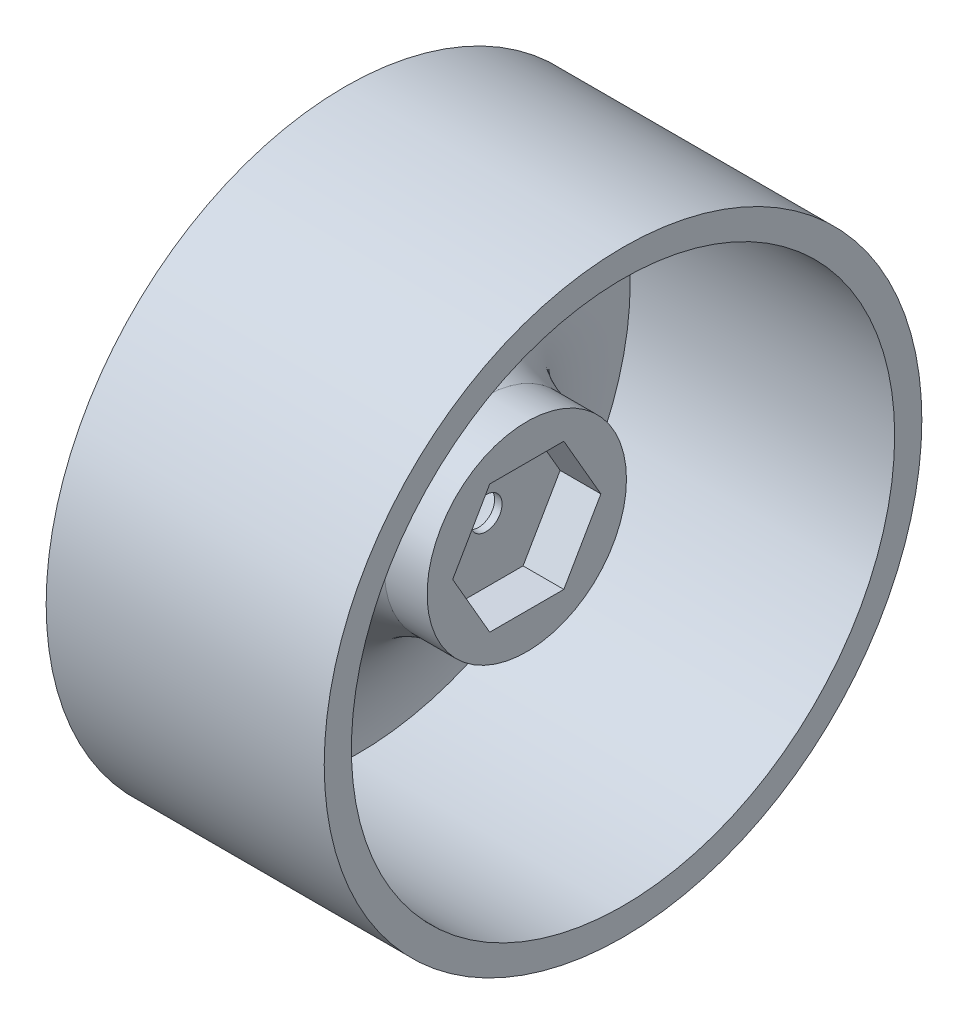
ISO-10303-21;
HEADER;
FILE_DESCRIPTION(('STEP AP214'),'2;1');
FILE_NAME('part.step','',(''),(''),'','','');
FILE_SCHEMA(('AUTOMOTIVE_DESIGN { 1 0 10303 214 1 1 1 1 }'));
ENDSEC;
DATA;
#1=APPLICATION_CONTEXT('core data for automotive mechanical design processes');
#2=APPLICATION_PROTOCOL_DEFINITION('international standard','automotive_design',2000,#1);
#3=PRODUCT_CONTEXT('',#1,'mechanical');
#4=PRODUCT('Part','Part','',(#3));
#5=PRODUCT_RELATED_PRODUCT_CATEGORY('part','',(#4));
#6=PRODUCT_DEFINITION_FORMATION('','',#4);
#7=PRODUCT_DEFINITION_CONTEXT('part definition',#1,'design');
#8=PRODUCT_DEFINITION('design','',#6,#7);
#9=PRODUCT_DEFINITION_SHAPE('','',#8);
#10=(LENGTH_UNIT() NAMED_UNIT(*) SI_UNIT(.MILLI.,.METRE.));
#11=(NAMED_UNIT(*) PLANE_ANGLE_UNIT() SI_UNIT($,.RADIAN.));
#12=(NAMED_UNIT(*) SI_UNIT($,.STERADIAN.) SOLID_ANGLE_UNIT());
#13=UNCERTAINTY_MEASURE_WITH_UNIT(LENGTH_MEASURE(1.E-05),#10,'distance_accuracy_value','');
#14=(GEOMETRIC_REPRESENTATION_CONTEXT(3) GLOBAL_UNCERTAINTY_ASSIGNED_CONTEXT((#13)) GLOBAL_UNIT_ASSIGNED_CONTEXT((#10,
#11,#12)) REPRESENTATION_CONTEXT('',''));
#15=CARTESIAN_POINT('',(0.,0.,0.));
#16=DIRECTION('',(0.,0.,1.));
#17=DIRECTION('',(1.,0.,0.));
#18=AXIS2_PLACEMENT_3D('',#15,#16,#17);
#19=CARTESIAN_POINT('',(4.,0.,0.));
#20=DIRECTION('',(1.,0.,0.));
#21=DIRECTION('',(0.,0.,-1.));
#22=AXIS2_PLACEMENT_3D('',#19,#20,#21);
#23=CYLINDRICAL_SURFACE('',#22,25.4);
#24=CARTESIAN_POINT('',(13.000000035,0.,0.));
#25=DIRECTION('',(1.,0.,0.));
#26=DIRECTION('',(0.,0.,-1.));
#27=AXIS2_PLACEMENT_3D('',#24,#25,#26);
#28=CIRCLE('',#27,25.4);
#29=CARTESIAN_POINT('',(13.000000035,0.,-25.4));
#30=VERTEX_POINT('',#29);
#31=EDGE_CURVE('E11',#30,#30,#28,.T.);
#32=ORIENTED_EDGE('',*,*,#31,.T.);
#33=EDGE_LOOP('',(#32));
#34=FACE_BOUND('',#33,.T.);
#35=CARTESIAN_POINT('',(-11.730000035,0.,0.));
#36=DIRECTION('',(1.,0.,0.));
#37=DIRECTION('',(0.,0.,-1.));
#38=AXIS2_PLACEMENT_3D('',#35,#36,#37);
#39=CIRCLE('',#38,25.4);
#40=CARTESIAN_POINT('',(-11.730000035,0.,-25.4));
#41=VERTEX_POINT('',#40);
#42=EDGE_CURVE('E140',#41,#41,#39,.T.);
#43=ORIENTED_EDGE('',*,*,#42,.F.);
#44=EDGE_LOOP('',(#43));
#45=FACE_BOUND('',#44,.T.);
#46=ADVANCED_FACE('F38',(#34,#45),#23,.F.);
#47=CARTESIAN_POINT('',(13.000000035,0.,-27.94));
#48=DIRECTION('',(-1.,0.,0.));
#49=DIRECTION('',(0.,0.,1.));
#50=AXIS2_PLACEMENT_3D('',#47,#48,#49);
#51=PLANE('',#50);
#52=ORIENTED_EDGE('',*,*,#31,.F.);
#53=EDGE_LOOP('',(#52));
#54=FACE_BOUND('',#53,.T.);
#55=CARTESIAN_POINT('',(13.000000035,0.,0.));
#56=DIRECTION('',(1.,0.,0.));
#57=DIRECTION('',(0.,0.,-1.));
#58=AXIS2_PLACEMENT_3D('',#55,#56,#57);
#59=CIRCLE('',#58,27.94);
#60=CARTESIAN_POINT('',(13.000000035,0.,-27.94));
#61=VERTEX_POINT('',#60);
#62=EDGE_CURVE('E46',#61,#61,#59,.T.);
#63=ORIENTED_EDGE('',*,*,#62,.T.);
#64=EDGE_LOOP('',(#63));
#65=FACE_BOUND('',#64,.T.);
#66=ADVANCED_FACE('F171',(#54,#65),#51,.F.);
#67=CARTESIAN_POINT('',(4.,0.,0.));
#68=DIRECTION('',(1.,0.,0.));
#69=DIRECTION('',(0.,0.,-1.));
#70=AXIS2_PLACEMENT_3D('',#67,#68,#69);
#71=CYLINDRICAL_SURFACE('',#70,27.94);
#72=ORIENTED_EDGE('',*,*,#62,.F.);
#73=EDGE_LOOP('',(#72));
#74=FACE_BOUND('',#73,.T.);
#75=CARTESIAN_POINT('',(-13.000000035,0.,0.));
#76=DIRECTION('',(1.,0.,0.));
#77=DIRECTION('',(0.,0.,-1.));
#78=AXIS2_PLACEMENT_3D('',#75,#76,#77);
#79=CIRCLE('',#78,27.94);
#80=CARTESIAN_POINT('',(-13.000000035,0.,-27.94));
#81=VERTEX_POINT('',#80);
#82=EDGE_CURVE('E183',#81,#81,#79,.T.);
#83=ORIENTED_EDGE('',*,*,#82,.T.);
#84=EDGE_LOOP('',(#83));
#85=FACE_BOUND('',#84,.T.);
#86=ADVANCED_FACE('F168',(#74,#85),#71,.T.);
#87=CARTESIAN_POINT('',(-13.000000035,0.,-25.4));
#88=DIRECTION('',(1.,0.,0.));
#89=DIRECTION('',(0.,0.,-1.));
#90=AXIS2_PLACEMENT_3D('',#87,#88,#89);
#91=PLANE('',#90);
#92=ORIENTED_EDGE('',*,*,#82,.F.);
#93=EDGE_LOOP('',(#92));
#94=FACE_BOUND('',#93,.T.);
#95=CARTESIAN_POINT('',(-13.000000035,0.,0.));
#96=DIRECTION('',(1.,0.,0.));
#97=DIRECTION('',(0.,0.,-1.));
#98=AXIS2_PLACEMENT_3D('',#95,#96,#97);
#99=CIRCLE('',#98,25.4);
#100=CARTESIAN_POINT('',(-13.000000035,0.,-25.4));
#101=VERTEX_POINT('',#100);
#102=EDGE_CURVE('E186',#101,#101,#99,.T.);
#103=ORIENTED_EDGE('',*,*,#102,.T.);
#104=EDGE_LOOP('',(#103));
#105=FACE_BOUND('',#104,.T.);
#106=ADVANCED_FACE('F163',(#94,#105),#91,.F.);
#107=CARTESIAN_POINT('',(-0.508,0.,-8.128));
#108=CARTESIAN_POINT('',(-13.159061445429,0.,-7.33668886150366));
#109=CARTESIAN_POINT('',(-13.000000035,0.,-25.4));
#110=B_SPLINE_CURVE_WITH_KNOTS('',2,(#107,#108,#109),.UNSPECIFIED.,.F.,.F.,(3,3),(0.,1.),.UNSPECIFIED.);
#111=CARTESIAN_POINT('',(4.,0.,0.));
#112=DIRECTION('',(1.,0.,0.));
#113=AXIS1_PLACEMENT('',#111,#112);
#114=SURFACE_OF_REVOLUTION('',#110,#113);
#115=ORIENTED_EDGE('',*,*,#102,.F.);
#116=EDGE_LOOP('',(#115));
#117=FACE_BOUND('',#116,.T.);
#118=CARTESIAN_POINT('',(-0.508,0.,0.));
#119=DIRECTION('',(1.,0.,0.));
#120=DIRECTION('',(0.,0.,-1.));
#121=AXIS2_PLACEMENT_3D('',#118,#119,#120);
#122=CIRCLE('',#121,8.128);
#123=CARTESIAN_POINT('',(-0.508,0.,-8.128));
#124=VERTEX_POINT('',#123);
#125=EDGE_CURVE('E191',#124,#124,#122,.T.);
#126=ORIENTED_EDGE('',*,*,#125,.T.);
#127=EDGE_LOOP('',(#126));
#128=FACE_BOUND('',#127,.T.);
#129=ADVANCED_FACE('F158',(#117,#128),#114,.T.);
#130=CARTESIAN_POINT('',(-0.508,0.,-8.128));
#131=DIRECTION('',(-1.,0.,0.));
#132=DIRECTION('',(0.,0.,1.));
#133=AXIS2_PLACEMENT_3D('',#130,#131,#132);
#134=PLANE('',#133);
#135=CARTESIAN_POINT('',(-0.508,0.,0.));
#136=DIRECTION('',(-1.,0.,0.));
#137=DIRECTION('',(0.,0.,1.));
#138=AXIS2_PLACEMENT_3D('',#135,#136,#137);
#139=CIRCLE('',#138,1.5);
#140=CARTESIAN_POINT('',(-0.508,0.,1.5));
#141=VERTEX_POINT('',#140);
#142=EDGE_CURVE('E236',#141,#141,#139,.T.);
#143=ORIENTED_EDGE('',*,*,#142,.F.);
#144=EDGE_LOOP('',(#143));
#145=FACE_BOUND('',#144,.T.);
#146=ORIENTED_EDGE('',*,*,#125,.F.);
#147=EDGE_LOOP('',(#146));
#148=FACE_BOUND('',#147,.T.);
#149=ADVANCED_FACE('F162',(#145,#148),#134,.T.);
#150=CARTESIAN_POINT('',(4.,0.,-8.05052812049922));
#151=DIRECTION('',(1.,0.,0.));
#152=DIRECTION('',(0.,0.,-1.));
#153=AXIS2_PLACEMENT_3D('',#150,#151,#152);
#154=PLANE('',#153);
#155=DIRECTION('',(0.,0.866025403784439,-0.5));
#156=VECTOR('',#155,1.);
#157=CARTESIAN_POINT('',(4.,-6.,-3.46410161513776));
#158=LINE('',#157,#156);
#159=CARTESIAN_POINT('',(4.,-6.,-3.46410161513776));
#160=VERTEX_POINT('',#159);
#161=CARTESIAN_POINT('',(4.,0.,-6.92820323027551));
#162=VERTEX_POINT('',#161);
#163=EDGE_CURVE('E53',#160,#162,#158,.T.);
#164=ORIENTED_EDGE('',*,*,#163,.F.);
#165=DIRECTION('',(0.,0.,-1.));
#166=VECTOR('',#165,1.);
#167=CARTESIAN_POINT('',(4.,-6.,3.46410161513776));
#168=LINE('',#167,#166);
#169=CARTESIAN_POINT('',(4.,-6.,3.46410161513776));
#170=VERTEX_POINT('',#169);
#171=EDGE_CURVE('E136',#170,#160,#168,.T.);
#172=ORIENTED_EDGE('',*,*,#171,.F.);
#173=DIRECTION('',(0.,-0.866025403784439,-0.5));
#174=VECTOR('',#173,1.);
#175=CARTESIAN_POINT('',(4.,0.,6.92820323027551));
#176=LINE('',#175,#174);
#177=CARTESIAN_POINT('',(4.,0.,6.92820323027551));
#178=VERTEX_POINT('',#177);
#179=EDGE_CURVE('E134',#178,#170,#176,.T.);
#180=ORIENTED_EDGE('',*,*,#179,.F.);
#181=DIRECTION('',(0.,-0.866025403784439,0.5));
#182=VECTOR('',#181,1.);
#183=CARTESIAN_POINT('',(4.,6.,3.46410161513776));
#184=LINE('',#183,#182);
#185=CARTESIAN_POINT('',(4.,6.,3.46410161513776));
#186=VERTEX_POINT('',#185);
#187=EDGE_CURVE('E101',#186,#178,#184,.T.);
#188=ORIENTED_EDGE('',*,*,#187,.F.);
#189=DIRECTION('',(0.,0.,1.));
#190=VECTOR('',#189,1.);
#191=CARTESIAN_POINT('',(4.,6.,-3.46410161513775));
#192=LINE('',#191,#190);
#193=CARTESIAN_POINT('',(4.,6.,-3.46410161513775));
#194=VERTEX_POINT('',#193);
#195=EDGE_CURVE('E130',#194,#186,#192,.T.);
#196=ORIENTED_EDGE('',*,*,#195,.F.);
#197=DIRECTION('',(0.,0.866025403784438,0.5));
#198=VECTOR('',#197,1.);
#199=CARTESIAN_POINT('',(4.,0.,-6.92820323027551));
#200=LINE('',#199,#198);
#201=EDGE_CURVE('E127',#162,#194,#200,.T.);
#202=ORIENTED_EDGE('',*,*,#201,.F.);
#203=EDGE_LOOP('',(#164,#172,#180,#188,#196,#202));
#204=FACE_BOUND('',#203,.T.);
#205=CARTESIAN_POINT('',(4.,0.,0.));
#206=DIRECTION('',(1.,0.,0.));
#207=DIRECTION('',(0.,0.,-1.));
#208=AXIS2_PLACEMENT_3D('',#205,#206,#207);
#209=CIRCLE('',#208,9.32052812049922);
#210=CARTESIAN_POINT('',(4.,0.,-9.32052812049922));
#211=VERTEX_POINT('',#210);
#212=EDGE_CURVE('E194',#211,#211,#209,.T.);
#213=ORIENTED_EDGE('',*,*,#212,.T.);
#214=EDGE_LOOP('',(#213));
#215=FACE_BOUND('',#214,.T.);
#216=ADVANCED_FACE('F216',(#204,#215),#154,.T.);
#217=CARTESIAN_POINT('',(4.,0.,0.));
#218=DIRECTION('',(1.,0.,0.));
#219=DIRECTION('',(0.,0.,-1.));
#220=AXIS2_PLACEMENT_3D('',#217,#218,#219);
#221=CYLINDRICAL_SURFACE('',#220,9.32052812049922);
#222=CARTESIAN_POINT('',(0.,0.,0.));
#223=DIRECTION('',(1.,0.,0.));
#224=DIRECTION('',(0.,0.,-1.));
#225=AXIS2_PLACEMENT_3D('',#222,#223,#224);
#226=CIRCLE('',#225,9.32052812049922);
#227=CARTESIAN_POINT('',(0.,0.,-9.32052812049922));
#228=VERTEX_POINT('',#227);
#229=EDGE_CURVE('E197',#228,#228,#226,.T.);
#230=ORIENTED_EDGE('',*,*,#229,.T.);
#231=EDGE_LOOP('',(#230));
#232=FACE_BOUND('',#231,.T.);
#233=ORIENTED_EDGE('',*,*,#212,.F.);
#234=EDGE_LOOP('',(#233));
#235=FACE_BOUND('',#234,.T.);
#236=ADVANCED_FACE('F206',(#232,#235),#221,.T.);
#237=CARTESIAN_POINT('',(-11.730000035,0.,-25.4));
#238=CARTESIAN_POINT('',(-11.9398521547983,0.,-16.1859849480506));
#239=CARTESIAN_POINT('',(-5.76762494118269,0.,-10.5734857522698));
#240=CARTESIAN_POINT('',(0.,0.,-9.32052812049922));
#241=B_SPLINE_CURVE_WITH_KNOTS('',3,(#237,#238,#239,#240),.UNSPECIFIED.,.F.,.F.,(4,4),(0.,1.),.UNSPECIFIED.);
#242=CARTESIAN_POINT('',(4.,0.,0.));
#243=DIRECTION('',(1.,0.,0.));
#244=AXIS1_PLACEMENT('',#242,#243);
#245=SURFACE_OF_REVOLUTION('',#241,#244);
#246=ORIENTED_EDGE('',*,*,#229,.F.);
#247=EDGE_LOOP('',(#246));
#248=FACE_BOUND('',#247,.T.);
#249=ORIENTED_EDGE('',*,*,#42,.T.);
#250=EDGE_LOOP('',(#249));
#251=FACE_BOUND('',#250,.T.);
#252=ADVANCED_FACE('F202',(#248,#251),#245,.T.);
#253=CARTESIAN_POINT('',(0.190000000000001,-6.,-3.46410161513776));
#254=DIRECTION('',(0.,-0.5,-0.866025403784439));
#255=DIRECTION('',(0.,0.866025403784439,-0.5));
#256=AXIS2_PLACEMENT_3D('',#253,#254,#255);
#257=PLANE('',#256);
#258=ORIENTED_EDGE('',*,*,#163,.T.);
#259=DIRECTION('',(1.,0.,0.));
#260=VECTOR('',#259,1.);
#261=CARTESIAN_POINT('',(0.190000000000001,0.,-6.92820323027551));
#262=LINE('',#261,#260);
#263=CARTESIAN_POINT('',(0.190000000000001,0.,-6.92820323027551));
#264=VERTEX_POINT('',#263);
#265=EDGE_CURVE('E83',#264,#162,#262,.T.);
#266=ORIENTED_EDGE('',*,*,#265,.F.);
#267=DIRECTION('',(0.,0.866025403784439,-0.5));
#268=VECTOR('',#267,1.);
#269=CARTESIAN_POINT('',(0.190000000000001,-6.,-3.46410161513776));
#270=LINE('',#269,#268);
#271=CARTESIAN_POINT('',(0.190000000000001,-6.,-3.46410161513776));
#272=VERTEX_POINT('',#271);
#273=EDGE_CURVE('E138',#272,#264,#270,.T.);
#274=ORIENTED_EDGE('',*,*,#273,.F.);
#275=DIRECTION('',(1.,0.,0.));
#276=VECTOR('',#275,1.);
#277=CARTESIAN_POINT('',(0.190000000000001,-6.,-3.46410161513776));
#278=LINE('',#277,#276);
#279=EDGE_CURVE('E61',#272,#160,#278,.T.);
#280=ORIENTED_EDGE('',*,*,#279,.T.);
#281=EDGE_LOOP('',(#258,#266,#274,#280));
#282=FACE_BOUND('',#281,.T.);
#283=ADVANCED_FACE('F205',(#282),#257,.F.);
#284=CARTESIAN_POINT('',(0.190000000000001,-6.,3.46410161513776));
#285=DIRECTION('',(0.,-1.,0.));
#286=DIRECTION('',(0.,0.,-1.));
#287=AXIS2_PLACEMENT_3D('',#284,#285,#286);
#288=PLANE('',#287);
#289=ORIENTED_EDGE('',*,*,#171,.T.);
#290=ORIENTED_EDGE('',*,*,#279,.F.);
#291=DIRECTION('',(0.,0.,-1.));
#292=VECTOR('',#291,1.);
#293=CARTESIAN_POINT('',(0.190000000000001,-6.,3.46410161513776));
#294=LINE('',#293,#292);
#295=CARTESIAN_POINT('',(0.190000000000001,-6.,3.46410161513776));
#296=VERTEX_POINT('',#295);
#297=EDGE_CURVE('E113',#296,#272,#294,.T.);
#298=ORIENTED_EDGE('',*,*,#297,.F.);
#299=DIRECTION('',(1.,0.,0.));
#300=VECTOR('',#299,1.);
#301=CARTESIAN_POINT('',(0.190000000000001,-6.,3.46410161513776));
#302=LINE('',#301,#300);
#303=EDGE_CURVE('E105',#296,#170,#302,.T.);
#304=ORIENTED_EDGE('',*,*,#303,.T.);
#305=EDGE_LOOP('',(#289,#290,#298,#304));
#306=FACE_BOUND('',#305,.T.);
#307=ADVANCED_FACE('F214',(#306),#288,.F.);
#308=CARTESIAN_POINT('',(0.190000000000001,0.,6.92820323027551));
#309=DIRECTION('',(0.,-0.5,0.866025403784439));
#310=DIRECTION('',(0.,-0.866025403784439,-0.5));
#311=AXIS2_PLACEMENT_3D('',#308,#309,#310);
#312=PLANE('',#311);
#313=ORIENTED_EDGE('',*,*,#179,.T.);
#314=ORIENTED_EDGE('',*,*,#303,.F.);
#315=DIRECTION('',(0.,-0.866025403784439,-0.5));
#316=VECTOR('',#315,1.);
#317=CARTESIAN_POINT('',(0.190000000000001,0.,6.92820323027551));
#318=LINE('',#317,#316);
#319=CARTESIAN_POINT('',(0.190000000000001,0.,6.92820323027551));
#320=VERTEX_POINT('',#319);
#321=EDGE_CURVE('E109',#320,#296,#318,.T.);
#322=ORIENTED_EDGE('',*,*,#321,.F.);
#323=DIRECTION('',(1.,0.,0.));
#324=VECTOR('',#323,1.);
#325=CARTESIAN_POINT('',(0.190000000000001,0.,6.92820323027551));
#326=LINE('',#325,#324);
#327=EDGE_CURVE('E94',#320,#178,#326,.T.);
#328=ORIENTED_EDGE('',*,*,#327,.T.);
#329=EDGE_LOOP('',(#313,#314,#322,#328));
#330=FACE_BOUND('',#329,.T.);
#331=ADVANCED_FACE('F110',(#330),#312,.F.);
#332=CARTESIAN_POINT('',(0.190000000000001,6.,3.46410161513776));
#333=DIRECTION('',(0.,0.5,0.866025403784439));
#334=DIRECTION('',(0.,-0.866025403784439,0.5));
#335=AXIS2_PLACEMENT_3D('',#332,#333,#334);
#336=PLANE('',#335);
#337=ORIENTED_EDGE('',*,*,#187,.T.);
#338=ORIENTED_EDGE('',*,*,#327,.F.);
#339=DIRECTION('',(0.,-0.866025403784439,0.5));
#340=VECTOR('',#339,1.);
#341=CARTESIAN_POINT('',(0.190000000000001,6.,3.46410161513776));
#342=LINE('',#341,#340);
#343=CARTESIAN_POINT('',(0.190000000000001,6.,3.46410161513776));
#344=VERTEX_POINT('',#343);
#345=EDGE_CURVE('E98',#344,#320,#342,.T.);
#346=ORIENTED_EDGE('',*,*,#345,.F.);
#347=DIRECTION('',(1.,0.,0.));
#348=VECTOR('',#347,1.);
#349=CARTESIAN_POINT('',(0.190000000000001,6.,3.46410161513776));
#350=LINE('',#349,#348);
#351=EDGE_CURVE('E106',#344,#186,#350,.T.);
#352=ORIENTED_EDGE('',*,*,#351,.T.);
#353=EDGE_LOOP('',(#337,#338,#346,#352));
#354=FACE_BOUND('',#353,.T.);
#355=ADVANCED_FACE('F96',(#354),#336,.F.);
#356=CARTESIAN_POINT('',(0.190000000000001,6.,-3.46410161513775));
#357=DIRECTION('',(0.,1.,0.));
#358=DIRECTION('',(0.,0.,1.));
#359=AXIS2_PLACEMENT_3D('',#356,#357,#358);
#360=PLANE('',#359);
#361=ORIENTED_EDGE('',*,*,#195,.T.);
#362=ORIENTED_EDGE('',*,*,#351,.F.);
#363=DIRECTION('',(0.,0.,1.));
#364=VECTOR('',#363,1.);
#365=CARTESIAN_POINT('',(0.190000000000001,6.,-3.46410161513775));
#366=LINE('',#365,#364);
#367=CARTESIAN_POINT('',(0.190000000000001,6.,-3.46410161513775));
#368=VERTEX_POINT('',#367);
#369=EDGE_CURVE('E119',#368,#344,#366,.T.);
#370=ORIENTED_EDGE('',*,*,#369,.F.);
#371=DIRECTION('',(1.,0.,0.));
#372=VECTOR('',#371,1.);
#373=CARTESIAN_POINT('',(0.190000000000001,6.,-3.46410161513775));
#374=LINE('',#373,#372);
#375=EDGE_CURVE('E143',#368,#194,#374,.T.);
#376=ORIENTED_EDGE('',*,*,#375,.T.);
#377=EDGE_LOOP('',(#361,#362,#370,#376));
#378=FACE_BOUND('',#377,.T.);
#379=ADVANCED_FACE('F252',(#378),#360,.F.);
#380=CARTESIAN_POINT('',(0.190000000000001,0.,-6.92820323027551));
#381=DIRECTION('',(0.,0.5,-0.866025403784438));
#382=DIRECTION('',(0.,0.866025403784439,0.5));
#383=AXIS2_PLACEMENT_3D('',#380,#381,#382);
#384=PLANE('',#383);
#385=ORIENTED_EDGE('',*,*,#201,.T.);
#386=ORIENTED_EDGE('',*,*,#375,.F.);
#387=DIRECTION('',(0.,0.866025403784438,0.5));
#388=VECTOR('',#387,1.);
#389=CARTESIAN_POINT('',(0.190000000000001,0.,-6.92820323027551));
#390=LINE('',#389,#388);
#391=EDGE_CURVE('E121',#264,#368,#390,.T.);
#392=ORIENTED_EDGE('',*,*,#391,.F.);
#393=ORIENTED_EDGE('',*,*,#265,.T.);
#394=EDGE_LOOP('',(#385,#386,#392,#393));
#395=FACE_BOUND('',#394,.T.);
#396=ADVANCED_FACE('F233',(#395),#384,.F.);
#397=CARTESIAN_POINT('',(0.190000000000001,0.,0.));
#398=DIRECTION('',(1.,0.,0.));
#399=DIRECTION('',(0.,0.,-1.));
#400=AXIS2_PLACEMENT_3D('',#397,#398,#399);
#401=PLANE('',#400);
#402=CARTESIAN_POINT('',(0.190000000000001,0.,0.));
#403=DIRECTION('',(1.,0.,0.));
#404=DIRECTION('',(0.,0.,-1.));
#405=AXIS2_PLACEMENT_3D('',#402,#403,#404);
#406=CIRCLE('',#405,1.5);
#407=CARTESIAN_POINT('',(0.190000000000001,0.,-1.5));
#408=VERTEX_POINT('',#407);
#409=EDGE_CURVE('E41',#408,#408,#406,.T.);
#410=ORIENTED_EDGE('',*,*,#409,.F.);
#411=EDGE_LOOP('',(#410));
#412=FACE_BOUND('',#411,.T.);
#413=ORIENTED_EDGE('',*,*,#273,.T.);
#414=ORIENTED_EDGE('',*,*,#391,.T.);
#415=ORIENTED_EDGE('',*,*,#369,.T.);
#416=ORIENTED_EDGE('',*,*,#345,.T.);
#417=ORIENTED_EDGE('',*,*,#321,.T.);
#418=ORIENTED_EDGE('',*,*,#297,.T.);
#419=EDGE_LOOP('',(#413,#414,#415,#416,#417,#418));
#420=FACE_BOUND('',#419,.T.);
#421=ADVANCED_FACE('F116',(#412,#420),#401,.T.);
#422=CARTESIAN_POINT('',(13.000000035,0.,0.));
#423=DIRECTION('',(-1.,0.,0.));
#424=DIRECTION('',(0.,0.,1.));
#425=AXIS2_PLACEMENT_3D('',#422,#423,#424);
#426=CYLINDRICAL_SURFACE('',#425,1.5);
#427=ORIENTED_EDGE('',*,*,#409,.T.);
#428=EDGE_LOOP('',(#427));
#429=FACE_BOUND('',#428,.T.);
#430=ORIENTED_EDGE('',*,*,#142,.T.);
#431=EDGE_LOOP('',(#430));
#432=FACE_BOUND('',#431,.T.);
#433=ADVANCED_FACE('F243',(#429,#432),#426,.F.);
#434=CLOSED_SHELL('',(#46,#66,#86,#106,#129,#149,#216,#236,#252,#283,#307,#331,#355,#379,#396,
#421,#433));
#435=MANIFOLD_SOLID_BREP('B2',#434);
#436=ADVANCED_BREP_SHAPE_REPRESENTATION('',(#18,#435),#14);
#437=SHAPE_DEFINITION_REPRESENTATION(#9,#436);
ENDSEC;
END-ISO-10303-21;
